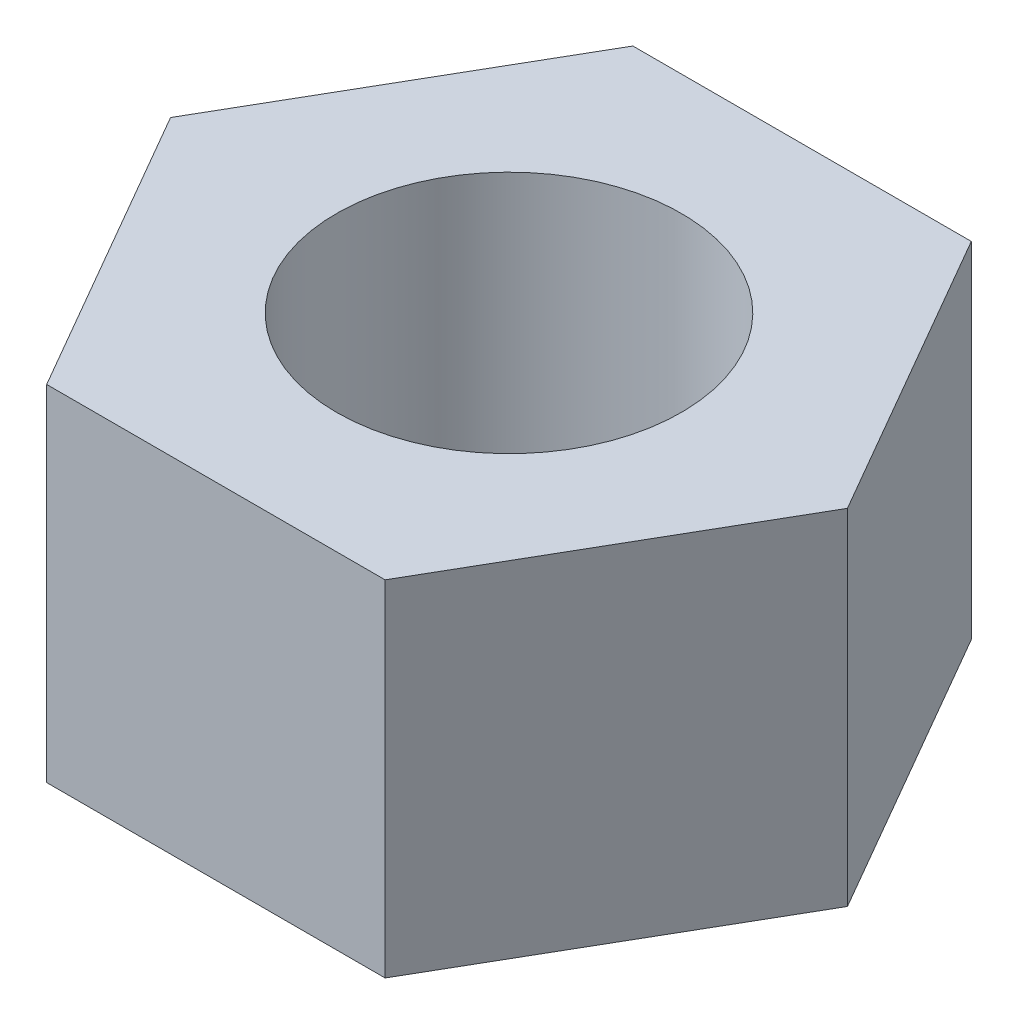
ISO-10303-21;
HEADER;
FILE_DESCRIPTION(('STEP AP214'),'2;1');
FILE_NAME('part.step','',(''),(''),'','','');
FILE_SCHEMA(('AUTOMOTIVE_DESIGN { 1 0 10303 214 1 1 1 1 }'));
ENDSEC;
DATA;
#1=APPLICATION_CONTEXT('core data for automotive mechanical design processes');
#2=APPLICATION_PROTOCOL_DEFINITION('international standard','automotive_design',2000,#1);
#3=PRODUCT_CONTEXT('',#1,'mechanical');
#4=PRODUCT('Part','Part','',(#3));
#5=PRODUCT_RELATED_PRODUCT_CATEGORY('part','',(#4));
#6=PRODUCT_DEFINITION_FORMATION('','',#4);
#7=PRODUCT_DEFINITION_CONTEXT('part definition',#1,'design');
#8=PRODUCT_DEFINITION('design','',#6,#7);
#9=PRODUCT_DEFINITION_SHAPE('','',#8);
#10=(LENGTH_UNIT() NAMED_UNIT(*) SI_UNIT(.MILLI.,.METRE.));
#11=(NAMED_UNIT(*) PLANE_ANGLE_UNIT() SI_UNIT($,.RADIAN.));
#12=(NAMED_UNIT(*) SI_UNIT($,.STERADIAN.) SOLID_ANGLE_UNIT());
#13=UNCERTAINTY_MEASURE_WITH_UNIT(LENGTH_MEASURE(1.E-05),#10,'distance_accuracy_value','');
#14=(GEOMETRIC_REPRESENTATION_CONTEXT(3) GLOBAL_UNCERTAINTY_ASSIGNED_CONTEXT((#13)) GLOBAL_UNIT_ASSIGNED_CONTEXT((#10,
#11,#12)) REPRESENTATION_CONTEXT('',''));
#15=CARTESIAN_POINT('',(0.,0.,0.));
#16=DIRECTION('',(0.,0.,1.));
#17=DIRECTION('',(1.,0.,0.));
#18=AXIS2_PLACEMENT_3D('',#15,#16,#17);
#19=CARTESIAN_POINT('',(0.,5.,0.));
#20=DIRECTION('',(0.,1.,0.));
#21=DIRECTION('',(0.,0.,1.));
#22=AXIS2_PLACEMENT_3D('',#19,#20,#21);
#23=PLANE('',#22);
#24=DIRECTION('',(0.5,0.,-0.866025403784439));
#25=VECTOR('',#24,1.);
#26=CARTESIAN_POINT('',(4.90747728811182,5.,8.50000000000001));
#27=LINE('',#26,#25);
#28=CARTESIAN_POINT('',(4.90747728811182,5.,8.50000000000001));
#29=VERTEX_POINT('',#28);
#30=CARTESIAN_POINT('',(9.81495457622364,5.,0.));
#31=VERTEX_POINT('',#30);
#32=EDGE_CURVE('E150',#29,#31,#27,.T.);
#33=ORIENTED_EDGE('',*,*,#32,.T.);
#34=DIRECTION('',(-0.5,0.,-0.866025403784439));
#35=VECTOR('',#34,1.);
#36=CARTESIAN_POINT('',(9.81495457622364,5.,0.));
#37=LINE('',#36,#35);
#38=CARTESIAN_POINT('',(4.90747728811182,5.,-8.5));
#39=VERTEX_POINT('',#38);
#40=EDGE_CURVE('E98',#31,#39,#37,.T.);
#41=ORIENTED_EDGE('',*,*,#40,.T.);
#42=DIRECTION('',(-1.,0.,0.));
#43=VECTOR('',#42,1.);
#44=CARTESIAN_POINT('',(4.90747728811182,5.,-8.5));
#45=LINE('',#44,#43);
#46=CARTESIAN_POINT('',(-4.90747728811182,5.,-8.5));
#47=VERTEX_POINT('',#46);
#48=EDGE_CURVE('E111',#39,#47,#45,.T.);
#49=ORIENTED_EDGE('',*,*,#48,.T.);
#50=DIRECTION('',(-0.5,0.,0.866025403784439));
#51=VECTOR('',#50,1.);
#52=CARTESIAN_POINT('',(-4.90747728811182,5.,-8.5));
#53=LINE('',#52,#51);
#54=CARTESIAN_POINT('',(-9.81495457622364,5.,0.));
#55=VERTEX_POINT('',#54);
#56=EDGE_CURVE('E105',#47,#55,#53,.T.);
#57=ORIENTED_EDGE('',*,*,#56,.T.);
#58=DIRECTION('',(0.5,0.,0.866025403784439));
#59=VECTOR('',#58,1.);
#60=CARTESIAN_POINT('',(-9.81495457622364,5.,0.));
#61=LINE('',#60,#59);
#62=CARTESIAN_POINT('',(-4.90747728811182,5.,8.5));
#63=VERTEX_POINT('',#62);
#64=EDGE_CURVE('E109',#55,#63,#61,.T.);
#65=ORIENTED_EDGE('',*,*,#64,.T.);
#66=DIRECTION('',(1.,0.,0.));
#67=VECTOR('',#66,1.);
#68=CARTESIAN_POINT('',(-4.90747728811182,5.,8.5));
#69=LINE('',#68,#67);
#70=EDGE_CURVE('E61',#63,#29,#69,.T.);
#71=ORIENTED_EDGE('',*,*,#70,.T.);
#72=EDGE_LOOP('',(#33,#41,#49,#57,#65,#71));
#73=FACE_BOUND('',#72,.T.);
#74=CARTESIAN_POINT('',(0.,5.,0.));
#75=DIRECTION('',(0.,1.,0.));
#76=DIRECTION('',(0.,0.,1.));
#77=AXIS2_PLACEMENT_3D('',#74,#75,#76);
#78=CIRCLE('',#77,5.);
#79=CARTESIAN_POINT('',(0.,5.,5.));
#80=VERTEX_POINT('',#79);
#81=EDGE_CURVE('E138',#80,#80,#78,.T.);
#82=ORIENTED_EDGE('',*,*,#81,.F.);
#83=EDGE_LOOP('',(#82));
#84=FACE_BOUND('',#83,.T.);
#85=ADVANCED_FACE('F43',(#73,#84),#23,.T.);
#86=CARTESIAN_POINT('',(0.,-5.,0.));
#87=DIRECTION('',(0.,1.,0.));
#88=DIRECTION('',(0.,0.,1.));
#89=AXIS2_PLACEMENT_3D('',#86,#87,#88);
#90=PLANE('',#89);
#91=DIRECTION('',(0.5,0.,-0.866025403784439));
#92=VECTOR('',#91,1.);
#93=CARTESIAN_POINT('',(4.90747728811182,-5.,8.50000000000001));
#94=LINE('',#93,#92);
#95=CARTESIAN_POINT('',(4.90747728811182,-5.,8.50000000000001));
#96=VERTEX_POINT('',#95);
#97=CARTESIAN_POINT('',(9.81495457622364,-5.,0.));
#98=VERTEX_POINT('',#97);
#99=EDGE_CURVE('E133',#96,#98,#94,.T.);
#100=ORIENTED_EDGE('',*,*,#99,.F.);
#101=DIRECTION('',(1.,0.,0.));
#102=VECTOR('',#101,1.);
#103=CARTESIAN_POINT('',(-4.90747728811182,-5.,8.5));
#104=LINE('',#103,#102);
#105=CARTESIAN_POINT('',(-4.90747728811182,-5.,8.5));
#106=VERTEX_POINT('',#105);
#107=EDGE_CURVE('E90',#106,#96,#104,.T.);
#108=ORIENTED_EDGE('',*,*,#107,.F.);
#109=DIRECTION('',(0.5,0.,0.866025403784439));
#110=VECTOR('',#109,1.);
#111=CARTESIAN_POINT('',(-9.81495457622364,-5.,0.));
#112=LINE('',#111,#110);
#113=CARTESIAN_POINT('',(-9.81495457622364,-5.,0.));
#114=VERTEX_POINT('',#113);
#115=EDGE_CURVE('E84',#114,#106,#112,.T.);
#116=ORIENTED_EDGE('',*,*,#115,.F.);
#117=DIRECTION('',(-0.5,0.,0.866025403784439));
#118=VECTOR('',#117,1.);
#119=CARTESIAN_POINT('',(-4.90747728811182,-5.,-8.5));
#120=LINE('',#119,#118);
#121=CARTESIAN_POINT('',(-4.90747728811182,-5.,-8.5));
#122=VERTEX_POINT('',#121);
#123=EDGE_CURVE('E120',#122,#114,#120,.T.);
#124=ORIENTED_EDGE('',*,*,#123,.F.);
#125=DIRECTION('',(-1.,0.,0.));
#126=VECTOR('',#125,1.);
#127=CARTESIAN_POINT('',(4.90747728811182,-5.,-8.5));
#128=LINE('',#127,#126);
#129=CARTESIAN_POINT('',(4.90747728811182,-5.,-8.5));
#130=VERTEX_POINT('',#129);
#131=EDGE_CURVE('E141',#130,#122,#128,.T.);
#132=ORIENTED_EDGE('',*,*,#131,.F.);
#133=DIRECTION('',(-0.5,0.,-0.866025403784439));
#134=VECTOR('',#133,1.);
#135=CARTESIAN_POINT('',(9.81495457622364,-5.,0.));
#136=LINE('',#135,#134);
#137=EDGE_CURVE('E137',#98,#130,#136,.T.);
#138=ORIENTED_EDGE('',*,*,#137,.F.);
#139=EDGE_LOOP('',(#100,#108,#116,#124,#132,#138));
#140=FACE_BOUND('',#139,.T.);
#141=CARTESIAN_POINT('',(0.,-5.,0.));
#142=DIRECTION('',(0.,1.,0.));
#143=DIRECTION('',(0.,0.,1.));
#144=AXIS2_PLACEMENT_3D('',#141,#142,#143);
#145=CIRCLE('',#144,5.);
#146=CARTESIAN_POINT('',(0.,-5.,5.));
#147=VERTEX_POINT('',#146);
#148=EDGE_CURVE('E265',#147,#147,#145,.T.);
#149=ORIENTED_EDGE('',*,*,#148,.T.);
#150=EDGE_LOOP('',(#149));
#151=FACE_BOUND('',#150,.T.);
#152=ADVANCED_FACE('F163',(#140,#151),#90,.F.);
#153=CARTESIAN_POINT('',(4.90747728811182,5.,8.50000000000001));
#154=DIRECTION('',(-0.866025403784439,0.,-0.5));
#155=DIRECTION('',(-0.5,0.,0.866025403784439));
#156=AXIS2_PLACEMENT_3D('',#153,#154,#155);
#157=PLANE('',#156);
#158=ORIENTED_EDGE('',*,*,#99,.T.);
#159=DIRECTION('',(0.,-1.,0.));
#160=VECTOR('',#159,1.);
#161=CARTESIAN_POINT('',(9.81495457622364,5.,0.));
#162=LINE('',#161,#160);
#163=EDGE_CURVE('E11',#31,#98,#162,.T.);
#164=ORIENTED_EDGE('',*,*,#163,.F.);
#165=ORIENTED_EDGE('',*,*,#32,.F.);
#166=DIRECTION('',(0.,-1.,0.));
#167=VECTOR('',#166,1.);
#168=CARTESIAN_POINT('',(4.90747728811182,5.,8.50000000000001));
#169=LINE('',#168,#167);
#170=EDGE_CURVE('E129',#29,#96,#169,.T.);
#171=ORIENTED_EDGE('',*,*,#170,.T.);
#172=EDGE_LOOP('',(#158,#164,#165,#171));
#173=FACE_BOUND('',#172,.T.);
#174=ADVANCED_FACE('F45',(#173),#157,.F.);
#175=CARTESIAN_POINT('',(9.81495457622364,5.,0.));
#176=DIRECTION('',(-0.866025403784439,0.,0.5));
#177=DIRECTION('',(0.5,0.,0.866025403784439));
#178=AXIS2_PLACEMENT_3D('',#175,#176,#177);
#179=PLANE('',#178);
#180=ORIENTED_EDGE('',*,*,#137,.T.);
#181=DIRECTION('',(0.,-1.,0.));
#182=VECTOR('',#181,1.);
#183=CARTESIAN_POINT('',(4.90747728811182,5.,-8.5));
#184=LINE('',#183,#182);
#185=EDGE_CURVE('E53',#39,#130,#184,.T.);
#186=ORIENTED_EDGE('',*,*,#185,.F.);
#187=ORIENTED_EDGE('',*,*,#40,.F.);
#188=ORIENTED_EDGE('',*,*,#163,.T.);
#189=EDGE_LOOP('',(#180,#186,#187,#188));
#190=FACE_BOUND('',#189,.T.);
#191=ADVANCED_FACE('F188',(#190),#179,.F.);
#192=CARTESIAN_POINT('',(4.90747728811182,5.,-8.5));
#193=DIRECTION('',(0.,0.,1.));
#194=DIRECTION('',(1.,0.,0.));
#195=AXIS2_PLACEMENT_3D('',#192,#193,#194);
#196=PLANE('',#195);
#197=ORIENTED_EDGE('',*,*,#131,.T.);
#198=DIRECTION('',(0.,-1.,0.));
#199=VECTOR('',#198,1.);
#200=CARTESIAN_POINT('',(-4.90747728811182,5.,-8.5));
#201=LINE('',#200,#199);
#202=EDGE_CURVE('E122',#47,#122,#201,.T.);
#203=ORIENTED_EDGE('',*,*,#202,.F.);
#204=ORIENTED_EDGE('',*,*,#48,.F.);
#205=ORIENTED_EDGE('',*,*,#185,.T.);
#206=EDGE_LOOP('',(#197,#203,#204,#205));
#207=FACE_BOUND('',#206,.T.);
#208=ADVANCED_FACE('F160',(#207),#196,.F.);
#209=CARTESIAN_POINT('',(-4.90747728811182,5.,-8.5));
#210=DIRECTION('',(0.866025403784438,0.,0.5));
#211=DIRECTION('',(0.5,0.,-0.866025403784438));
#212=AXIS2_PLACEMENT_3D('',#209,#210,#211);
#213=PLANE('',#212);
#214=ORIENTED_EDGE('',*,*,#123,.T.);
#215=DIRECTION('',(0.,-1.,0.));
#216=VECTOR('',#215,1.);
#217=CARTESIAN_POINT('',(-9.81495457622364,5.,0.));
#218=LINE('',#217,#216);
#219=EDGE_CURVE('E117',#55,#114,#218,.T.);
#220=ORIENTED_EDGE('',*,*,#219,.F.);
#221=ORIENTED_EDGE('',*,*,#56,.F.);
#222=ORIENTED_EDGE('',*,*,#202,.T.);
#223=EDGE_LOOP('',(#214,#220,#221,#222));
#224=FACE_BOUND('',#223,.T.);
#225=ADVANCED_FACE('F118',(#224),#213,.F.);
#226=CARTESIAN_POINT('',(-9.81495457622364,5.,0.));
#227=DIRECTION('',(0.866025403784439,0.,-0.5));
#228=DIRECTION('',(-0.5,0.,-0.866025403784439));
#229=AXIS2_PLACEMENT_3D('',#226,#227,#228);
#230=PLANE('',#229);
#231=ORIENTED_EDGE('',*,*,#115,.T.);
#232=DIRECTION('',(0.,-1.,0.));
#233=VECTOR('',#232,1.);
#234=CARTESIAN_POINT('',(-4.90747728811182,5.,8.5));
#235=LINE('',#234,#233);
#236=EDGE_CURVE('E123',#63,#106,#235,.T.);
#237=ORIENTED_EDGE('',*,*,#236,.F.);
#238=ORIENTED_EDGE('',*,*,#64,.F.);
#239=ORIENTED_EDGE('',*,*,#219,.T.);
#240=EDGE_LOOP('',(#231,#237,#238,#239));
#241=FACE_BOUND('',#240,.T.);
#242=ADVANCED_FACE('F125',(#241),#230,.F.);
#243=CARTESIAN_POINT('',(-4.90747728811182,5.,8.5));
#244=DIRECTION('',(0.,0.,-1.));
#245=DIRECTION('',(-1.,0.,0.));
#246=AXIS2_PLACEMENT_3D('',#243,#244,#245);
#247=PLANE('',#246);
#248=ORIENTED_EDGE('',*,*,#107,.T.);
#249=ORIENTED_EDGE('',*,*,#170,.F.);
#250=ORIENTED_EDGE('',*,*,#70,.F.);
#251=ORIENTED_EDGE('',*,*,#236,.T.);
#252=EDGE_LOOP('',(#248,#249,#250,#251));
#253=FACE_BOUND('',#252,.T.);
#254=ADVANCED_FACE('F168',(#253),#247,.F.);
#255=CARTESIAN_POINT('',(0.,5.,0.));
#256=DIRECTION('',(0.,-1.,0.));
#257=DIRECTION('',(0.,0.,-1.));
#258=AXIS2_PLACEMENT_3D('',#255,#256,#257);
#259=CYLINDRICAL_SURFACE('',#258,5.);
#260=ORIENTED_EDGE('',*,*,#81,.T.);
#261=EDGE_LOOP('',(#260));
#262=FACE_BOUND('',#261,.T.);
#263=ORIENTED_EDGE('',*,*,#148,.F.);
#264=EDGE_LOOP('',(#263));
#265=FACE_BOUND('',#264,.T.);
#266=ADVANCED_FACE('F170',(#262,#265),#259,.F.);
#267=CLOSED_SHELL('',(#85,#152,#174,#191,#208,#225,#242,#254,#266));
#268=MANIFOLD_SOLID_BREP('B2',#267);
#269=ADVANCED_BREP_SHAPE_REPRESENTATION('',(#18,#268),#14);
#270=SHAPE_DEFINITION_REPRESENTATION(#9,#269);
ENDSEC;
END-ISO-10303-21;
